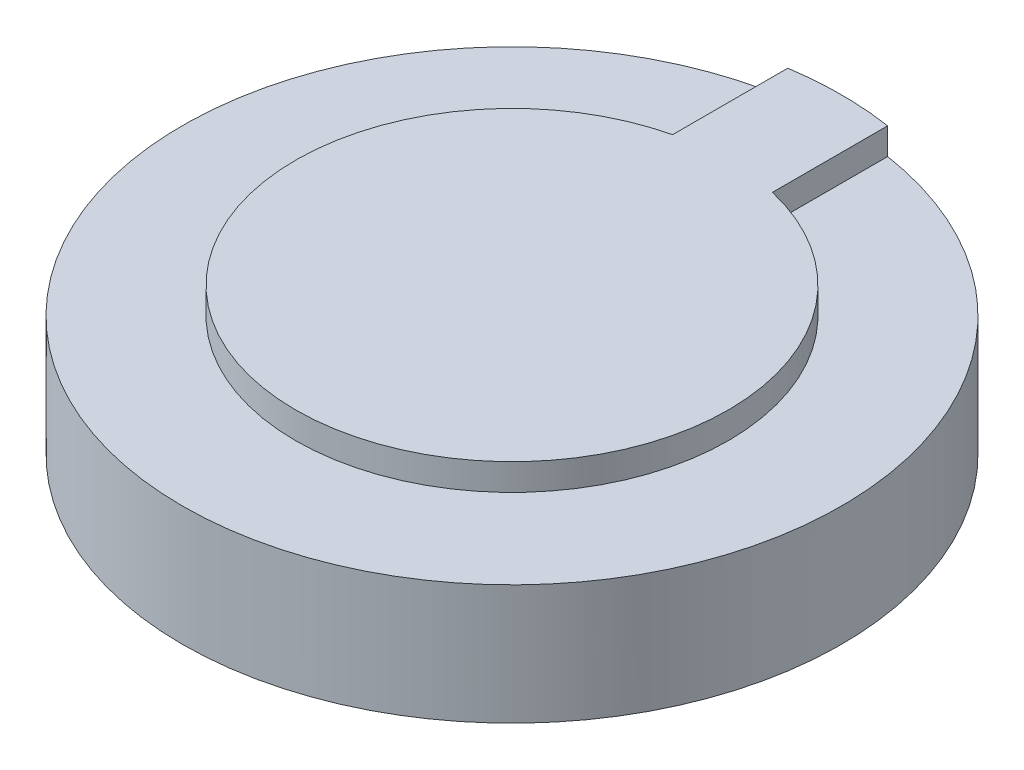
ISO-10303-21;
HEADER;
FILE_DESCRIPTION(('STEP AP214'),'2;1');
FILE_NAME('part.step','',(''),(''),'','','');
FILE_SCHEMA(('AUTOMOTIVE_DESIGN { 1 0 10303 214 1 1 1 1 }'));
ENDSEC;
DATA;
#1=APPLICATION_CONTEXT('core data for automotive mechanical design processes');
#2=APPLICATION_PROTOCOL_DEFINITION('international standard','automotive_design',2000,#1);
#3=PRODUCT_CONTEXT('',#1,'mechanical');
#4=PRODUCT('Part','Part','',(#3));
#5=PRODUCT_RELATED_PRODUCT_CATEGORY('part','',(#4));
#6=PRODUCT_DEFINITION_FORMATION('','',#4);
#7=PRODUCT_DEFINITION_CONTEXT('part definition',#1,'design');
#8=PRODUCT_DEFINITION('design','',#6,#7);
#9=PRODUCT_DEFINITION_SHAPE('','',#8);
#10=(LENGTH_UNIT() NAMED_UNIT(*) SI_UNIT(.MILLI.,.METRE.));
#11=(NAMED_UNIT(*) PLANE_ANGLE_UNIT() SI_UNIT($,.RADIAN.));
#12=(NAMED_UNIT(*) SI_UNIT($,.STERADIAN.) SOLID_ANGLE_UNIT());
#13=UNCERTAINTY_MEASURE_WITH_UNIT(LENGTH_MEASURE(1.E-05),#10,'distance_accuracy_value','');
#14=(GEOMETRIC_REPRESENTATION_CONTEXT(3) GLOBAL_UNCERTAINTY_ASSIGNED_CONTEXT((#13)) GLOBAL_UNIT_ASSIGNED_CONTEXT((#10,
#11,#12)) REPRESENTATION_CONTEXT('',''));
#15=CARTESIAN_POINT('',(0.,0.,0.));
#16=DIRECTION('',(0.,0.,1.));
#17=DIRECTION('',(1.,0.,0.));
#18=AXIS2_PLACEMENT_3D('',#15,#16,#17);
#19=CARTESIAN_POINT('',(0.,3.6,-9.9));
#20=DIRECTION('',(0.,-1.,0.));
#21=DIRECTION('',(0.,0.,-1.));
#22=AXIS2_PLACEMENT_3D('',#19,#20,#21);
#23=PLANE('',#22);
#24=DIRECTION('',(0.,0.,1.));
#25=VECTOR('',#24,1.);
#26=CARTESIAN_POINT('',(-1.5,3.6,-6.32455532033676));
#27=LINE('',#26,#25);
#28=CARTESIAN_POINT('',(-1.5,3.6,-9.78570385818006));
#29=VERTEX_POINT('',#28);
#30=CARTESIAN_POINT('',(-1.5,3.6,-6.32455532033676));
#31=VERTEX_POINT('',#30);
#32=EDGE_CURVE('E103',#29,#31,#27,.T.);
#33=ORIENTED_EDGE('',*,*,#32,.F.);
#34=CARTESIAN_POINT('',(0.,3.6,0.));
#35=DIRECTION('',(0.,1.,0.));
#36=DIRECTION('',(0.,0.,1.));
#37=AXIS2_PLACEMENT_3D('',#34,#35,#36);
#38=CIRCLE('',#37,9.9);
#39=CARTESIAN_POINT('',(1.5,3.6,-9.78570385818005));
#40=VERTEX_POINT('',#39);
#41=EDGE_CURVE('E42',#29,#40,#38,.T.);
#42=ORIENTED_EDGE('',*,*,#41,.T.);
#43=DIRECTION('',(0.,0.,-1.));
#44=VECTOR('',#43,1.);
#45=CARTESIAN_POINT('',(1.5,3.6,-6.32455532033676));
#46=LINE('',#45,#44);
#47=CARTESIAN_POINT('',(1.5,3.6,-6.32455532033676));
#48=VERTEX_POINT('',#47);
#49=EDGE_CURVE('E102',#48,#40,#46,.T.);
#50=ORIENTED_EDGE('',*,*,#49,.F.);
#51=CARTESIAN_POINT('',(0.,3.6,0.));
#52=DIRECTION('',(0.,1.,0.));
#53=DIRECTION('',(0.,0.,1.));
#54=AXIS2_PLACEMENT_3D('',#51,#52,#53);
#55=CIRCLE('',#54,6.5);
#56=EDGE_CURVE('E93',#31,#48,#55,.T.);
#57=ORIENTED_EDGE('',*,*,#56,.F.);
#58=EDGE_LOOP('',(#33,#42,#50,#57));
#59=FACE_BOUND('',#58,.T.);
#60=ADVANCED_FACE('F34',(#59),#23,.F.);
#61=CARTESIAN_POINT('',(0.,4.4,0.));
#62=DIRECTION('',(0.,1.,0.));
#63=DIRECTION('',(0.,0.,1.));
#64=AXIS2_PLACEMENT_3D('',#61,#62,#63);
#65=CYLINDRICAL_SURFACE('',#64,6.5);
#66=DIRECTION('',(0.,-1.,0.));
#67=VECTOR('',#66,1.);
#68=CARTESIAN_POINT('',(-1.5,4.4,-6.32455532033676));
#69=LINE('',#68,#67);
#70=CARTESIAN_POINT('',(-1.5,4.4,-6.32455532033676));
#71=VERTEX_POINT('',#70);
#72=EDGE_CURVE('E49',#71,#31,#69,.T.);
#73=ORIENTED_EDGE('',*,*,#72,.T.);
#74=ORIENTED_EDGE('',*,*,#56,.T.);
#75=DIRECTION('',(0.,-1.,0.));
#76=VECTOR('',#75,1.);
#77=CARTESIAN_POINT('',(1.5,4.4,-6.32455532033676));
#78=LINE('',#77,#76);
#79=CARTESIAN_POINT('',(1.5,4.4,-6.32455532033676));
#80=VERTEX_POINT('',#79);
#81=EDGE_CURVE('E80',#80,#48,#78,.T.);
#82=ORIENTED_EDGE('',*,*,#81,.F.);
#83=CARTESIAN_POINT('',(0.,4.4,0.));
#84=DIRECTION('',(0.,1.,0.));
#85=DIRECTION('',(0.,0.,1.));
#86=AXIS2_PLACEMENT_3D('',#83,#84,#85);
#87=CIRCLE('',#86,6.5);
#88=EDGE_CURVE('E91',#71,#80,#87,.T.);
#89=ORIENTED_EDGE('',*,*,#88,.F.);
#90=EDGE_LOOP('',(#73,#74,#82,#89));
#91=FACE_BOUND('',#90,.T.);
#92=ADVANCED_FACE('F90',(#91),#65,.T.);
#93=CARTESIAN_POINT('',(0.,0.,0.));
#94=DIRECTION('',(0.,1.,0.));
#95=DIRECTION('',(0.,0.,1.));
#96=AXIS2_PLACEMENT_3D('',#93,#94,#95);
#97=PLANE('',#96);
#98=CARTESIAN_POINT('',(0.,0.,0.));
#99=DIRECTION('',(0.,1.,0.));
#100=DIRECTION('',(0.,0.,1.));
#101=AXIS2_PLACEMENT_3D('',#98,#99,#100);
#102=CIRCLE('',#101,9.9);
#103=CARTESIAN_POINT('',(0.,0.,9.9));
#104=VERTEX_POINT('',#103);
#105=EDGE_CURVE('E11',#104,#104,#102,.T.);
#106=ORIENTED_EDGE('',*,*,#105,.F.);
#107=EDGE_LOOP('',(#106));
#108=FACE_BOUND('',#107,.T.);
#109=ADVANCED_FACE('F36',(#108),#97,.F.);
#110=CARTESIAN_POINT('',(0.,4.4,0.));
#111=DIRECTION('',(0.,1.,0.));
#112=DIRECTION('',(0.,0.,1.));
#113=AXIS2_PLACEMENT_3D('',#110,#111,#112);
#114=CYLINDRICAL_SURFACE('',#113,9.9);
#115=ORIENTED_EDGE('',*,*,#41,.F.);
#116=DIRECTION('',(0.,-1.,0.));
#117=VECTOR('',#116,1.);
#118=CARTESIAN_POINT('',(-1.5,4.4,-9.78570385818006));
#119=LINE('',#118,#117);
#120=CARTESIAN_POINT('',(-1.5,4.4,-9.78570385818006));
#121=VERTEX_POINT('',#120);
#122=EDGE_CURVE('E72',#121,#29,#119,.T.);
#123=ORIENTED_EDGE('',*,*,#122,.F.);
#124=CARTESIAN_POINT('',(0.,4.4,0.));
#125=DIRECTION('',(0.,1.,0.));
#126=DIRECTION('',(0.,0.,1.));
#127=AXIS2_PLACEMENT_3D('',#124,#125,#126);
#128=CIRCLE('',#127,9.9);
#129=CARTESIAN_POINT('',(1.5,4.4,-9.78570385818005));
#130=VERTEX_POINT('',#129);
#131=EDGE_CURVE('E57',#130,#121,#128,.T.);
#132=ORIENTED_EDGE('',*,*,#131,.F.);
#133=DIRECTION('',(0.,-1.,0.));
#134=VECTOR('',#133,1.);
#135=CARTESIAN_POINT('',(1.5,4.4,-9.78570385818005));
#136=LINE('',#135,#134);
#137=EDGE_CURVE('E83',#130,#40,#136,.T.);
#138=ORIENTED_EDGE('',*,*,#137,.T.);
#139=EDGE_LOOP('',(#115,#123,#132,#138));
#140=FACE_BOUND('',#139,.T.);
#141=ORIENTED_EDGE('',*,*,#105,.T.);
#142=EDGE_LOOP('',(#141));
#143=FACE_BOUND('',#142,.T.);
#144=ADVANCED_FACE('F105',(#140,#143),#114,.T.);
#145=CARTESIAN_POINT('',(0.,4.4,-6.5));
#146=DIRECTION('',(0.,-1.,0.));
#147=DIRECTION('',(0.,0.,-1.));
#148=AXIS2_PLACEMENT_3D('',#145,#146,#147);
#149=PLANE('',#148);
#150=ORIENTED_EDGE('',*,*,#88,.T.);
#151=DIRECTION('',(0.,0.,-1.));
#152=VECTOR('',#151,1.);
#153=CARTESIAN_POINT('',(1.5,4.4,-6.32455532033676));
#154=LINE('',#153,#152);
#155=EDGE_CURVE('E77',#80,#130,#154,.T.);
#156=ORIENTED_EDGE('',*,*,#155,.T.);
#157=ORIENTED_EDGE('',*,*,#131,.T.);
#158=DIRECTION('',(0.,0.,1.));
#159=VECTOR('',#158,1.);
#160=CARTESIAN_POINT('',(-1.5,4.4,-6.32455532033676));
#161=LINE('',#160,#159);
#162=EDGE_CURVE('E85',#121,#71,#161,.T.);
#163=ORIENTED_EDGE('',*,*,#162,.T.);
#164=EDGE_LOOP('',(#150,#156,#157,#163));
#165=FACE_BOUND('',#164,.T.);
#166=ADVANCED_FACE('F95',(#165),#149,.F.);
#167=CARTESIAN_POINT('',(-1.5,4.4,-6.32455532033676));
#168=DIRECTION('',(1.,0.,0.));
#169=DIRECTION('',(0.,0.,-1.));
#170=AXIS2_PLACEMENT_3D('',#167,#168,#169);
#171=PLANE('',#170);
#172=ORIENTED_EDGE('',*,*,#32,.T.);
#173=ORIENTED_EDGE('',*,*,#72,.F.);
#174=ORIENTED_EDGE('',*,*,#162,.F.);
#175=ORIENTED_EDGE('',*,*,#122,.T.);
#176=EDGE_LOOP('',(#172,#173,#174,#175));
#177=FACE_BOUND('',#176,.T.);
#178=ADVANCED_FACE('F113',(#177),#171,.F.);
#179=CARTESIAN_POINT('',(1.5,4.4,-6.32455532033676));
#180=DIRECTION('',(-1.,0.,0.));
#181=DIRECTION('',(0.,0.,1.));
#182=AXIS2_PLACEMENT_3D('',#179,#180,#181);
#183=PLANE('',#182);
#184=ORIENTED_EDGE('',*,*,#49,.T.);
#185=ORIENTED_EDGE('',*,*,#137,.F.);
#186=ORIENTED_EDGE('',*,*,#155,.F.);
#187=ORIENTED_EDGE('',*,*,#81,.T.);
#188=EDGE_LOOP('',(#184,#185,#186,#187));
#189=FACE_BOUND('',#188,.T.);
#190=ADVANCED_FACE('F79',(#189),#183,.F.);
#191=CLOSED_SHELL('',(#60,#92,#109,#144,#166,#178,#190));
#192=MANIFOLD_SOLID_BREP('B2',#191);
#193=ADVANCED_BREP_SHAPE_REPRESENTATION('',(#18,#192),#14);
#194=SHAPE_DEFINITION_REPRESENTATION(#9,#193);
ENDSEC;
END-ISO-10303-21;
